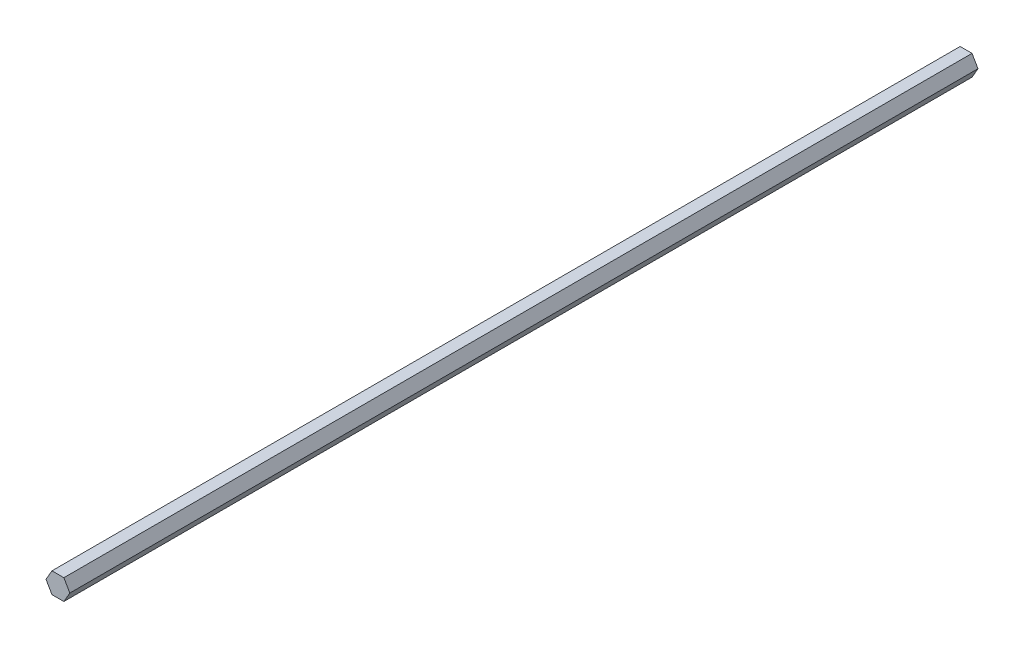
ISO-10303-21;
HEADER;
FILE_DESCRIPTION(('STEP AP214'),'2;1');
FILE_NAME('part.step','',(''),(''),'','','');
FILE_SCHEMA(('AUTOMOTIVE_DESIGN { 1 0 10303 214 1 1 1 1 }'));
ENDSEC;
DATA;
#1=APPLICATION_CONTEXT('core data for automotive mechanical design processes');
#2=APPLICATION_PROTOCOL_DEFINITION('international standard','automotive_design',2000,#1);
#3=PRODUCT_CONTEXT('',#1,'mechanical');
#4=PRODUCT('Part','Part','',(#3));
#5=PRODUCT_RELATED_PRODUCT_CATEGORY('part','',(#4));
#6=PRODUCT_DEFINITION_FORMATION('','',#4);
#7=PRODUCT_DEFINITION_CONTEXT('part definition',#1,'design');
#8=PRODUCT_DEFINITION('design','',#6,#7);
#9=PRODUCT_DEFINITION_SHAPE('','',#8);
#10=(LENGTH_UNIT() NAMED_UNIT(*) SI_UNIT(.MILLI.,.METRE.));
#11=(NAMED_UNIT(*) PLANE_ANGLE_UNIT() SI_UNIT($,.RADIAN.));
#12=(NAMED_UNIT(*) SI_UNIT($,.STERADIAN.) SOLID_ANGLE_UNIT());
#13=UNCERTAINTY_MEASURE_WITH_UNIT(LENGTH_MEASURE(1.E-05),#10,'distance_accuracy_value','');
#14=(GEOMETRIC_REPRESENTATION_CONTEXT(3) GLOBAL_UNCERTAINTY_ASSIGNED_CONTEXT((#13)) GLOBAL_UNIT_ASSIGNED_CONTEXT((#10,
#11,#12)) REPRESENTATION_CONTEXT('',''));
#15=CARTESIAN_POINT('',(0.,0.,0.));
#16=DIRECTION('',(0.,0.,1.));
#17=DIRECTION('',(1.,0.,0.));
#18=AXIS2_PLACEMENT_3D('',#15,#16,#17);
#19=CARTESIAN_POINT('',(-3.66617420935412,-6.35,558.8));
#20=DIRECTION('',(0.,1.,0.));
#21=DIRECTION('',(0.,0.,1.));
#22=AXIS2_PLACEMENT_3D('',#19,#20,#21);
#23=PLANE('',#22);
#24=DIRECTION('',(1.,0.,0.));
#25=VECTOR('',#24,1.);
#26=CARTESIAN_POINT('',(-3.66617420935412,-6.35,0.));
#27=LINE('',#26,#25);
#28=CARTESIAN_POINT('',(-3.66617420935412,-6.35,0.));
#29=VERTEX_POINT('',#28);
#30=CARTESIAN_POINT('',(3.66617420935412,-6.35,0.));
#31=VERTEX_POINT('',#30);
#32=EDGE_CURVE('E119',#29,#31,#27,.T.);
#33=ORIENTED_EDGE('',*,*,#32,.T.);
#34=DIRECTION('',(0.,0.,-1.));
#35=VECTOR('',#34,1.);
#36=CARTESIAN_POINT('',(3.66617420935412,-6.35,558.8));
#37=LINE('',#36,#35);
#38=CARTESIAN_POINT('',(3.66617420935412,-6.35,558.8));
#39=VERTEX_POINT('',#38);
#40=EDGE_CURVE('E11',#39,#31,#37,.T.);
#41=ORIENTED_EDGE('',*,*,#40,.F.);
#42=DIRECTION('',(1.,0.,0.));
#43=VECTOR('',#42,1.);
#44=CARTESIAN_POINT('',(-3.66617420935412,-6.35,558.8));
#45=LINE('',#44,#43);
#46=CARTESIAN_POINT('',(-3.66617420935412,-6.35,558.8));
#47=VERTEX_POINT('',#46);
#48=EDGE_CURVE('E129',#47,#39,#45,.T.);
#49=ORIENTED_EDGE('',*,*,#48,.F.);
#50=DIRECTION('',(0.,0.,-1.));
#51=VECTOR('',#50,1.);
#52=CARTESIAN_POINT('',(-3.66617420935412,-6.35,558.8));
#53=LINE('',#52,#51);
#54=EDGE_CURVE('E115',#47,#29,#53,.T.);
#55=ORIENTED_EDGE('',*,*,#54,.T.);
#56=EDGE_LOOP('',(#33,#41,#49,#55));
#57=FACE_BOUND('',#56,.T.);
#58=ADVANCED_FACE('F35',(#57),#23,.F.);
#59=CARTESIAN_POINT('',(3.66617420935412,-6.35,558.8));
#60=DIRECTION('',(-0.866025403784439,0.5,0.));
#61=DIRECTION('',(-0.5,-0.866025403784439,0.));
#62=AXIS2_PLACEMENT_3D('',#59,#60,#61);
#63=PLANE('',#62);
#64=DIRECTION('',(0.5,0.866025403784439,0.));
#65=VECTOR('',#64,1.);
#66=CARTESIAN_POINT('',(3.66617420935412,-6.35,0.));
#67=LINE('',#66,#65);
#68=CARTESIAN_POINT('',(7.33234841870824,0.,0.));
#69=VERTEX_POINT('',#68);
#70=EDGE_CURVE('E122',#31,#69,#67,.T.);
#71=ORIENTED_EDGE('',*,*,#70,.T.);
#72=DIRECTION('',(0.,0.,-1.));
#73=VECTOR('',#72,1.);
#74=CARTESIAN_POINT('',(7.33234841870824,0.,558.8));
#75=LINE('',#74,#73);
#76=CARTESIAN_POINT('',(7.33234841870824,0.,558.8));
#77=VERTEX_POINT('',#76);
#78=EDGE_CURVE('E43',#77,#69,#75,.T.);
#79=ORIENTED_EDGE('',*,*,#78,.F.);
#80=DIRECTION('',(0.5,0.866025403784439,0.));
#81=VECTOR('',#80,1.);
#82=CARTESIAN_POINT('',(3.66617420935412,-6.35,558.8));
#83=LINE('',#82,#81);
#84=EDGE_CURVE('E88',#39,#77,#83,.T.);
#85=ORIENTED_EDGE('',*,*,#84,.F.);
#86=ORIENTED_EDGE('',*,*,#40,.T.);
#87=EDGE_LOOP('',(#71,#79,#85,#86));
#88=FACE_BOUND('',#87,.T.);
#89=ADVANCED_FACE('F153',(#88),#63,.F.);
#90=CARTESIAN_POINT('',(7.33234841870824,0.,558.8));
#91=DIRECTION('',(-0.866025403784438,-0.5,0.));
#92=DIRECTION('',(0.5,-0.866025403784438,0.));
#93=AXIS2_PLACEMENT_3D('',#90,#91,#92);
#94=PLANE('',#93);
#95=DIRECTION('',(-0.5,0.866025403784438,0.));
#96=VECTOR('',#95,1.);
#97=CARTESIAN_POINT('',(7.33234841870824,0.,0.));
#98=LINE('',#97,#96);
#99=CARTESIAN_POINT('',(3.66617420935412,6.35,0.));
#100=VERTEX_POINT('',#99);
#101=EDGE_CURVE('E124',#69,#100,#98,.T.);
#102=ORIENTED_EDGE('',*,*,#101,.T.);
#103=DIRECTION('',(0.,0.,-1.));
#104=VECTOR('',#103,1.);
#105=CARTESIAN_POINT('',(3.66617420935412,6.35,558.8));
#106=LINE('',#105,#104);
#107=CARTESIAN_POINT('',(3.66617420935412,6.35,558.8));
#108=VERTEX_POINT('',#107);
#109=EDGE_CURVE('E110',#108,#100,#106,.T.);
#110=ORIENTED_EDGE('',*,*,#109,.F.);
#111=DIRECTION('',(-0.5,0.866025403784438,0.));
#112=VECTOR('',#111,1.);
#113=CARTESIAN_POINT('',(7.33234841870824,0.,558.8));
#114=LINE('',#113,#112);
#115=EDGE_CURVE('E101',#77,#108,#114,.T.);
#116=ORIENTED_EDGE('',*,*,#115,.F.);
#117=ORIENTED_EDGE('',*,*,#78,.T.);
#118=EDGE_LOOP('',(#102,#110,#116,#117));
#119=FACE_BOUND('',#118,.T.);
#120=ADVANCED_FACE('F135',(#119),#94,.F.);
#121=CARTESIAN_POINT('',(3.66617420935412,6.35,558.8));
#122=DIRECTION('',(0.,-1.,0.));
#123=DIRECTION('',(1.,0.,0.));
#124=AXIS2_PLACEMENT_3D('',#121,#122,#123);
#125=PLANE('',#124);
#126=DIRECTION('',(-1.,0.,0.));
#127=VECTOR('',#126,1.);
#128=CARTESIAN_POINT('',(3.66617420935412,6.35,0.));
#129=LINE('',#128,#127);
#130=CARTESIAN_POINT('',(-3.66617420935413,6.35,0.));
#131=VERTEX_POINT('',#130);
#132=EDGE_CURVE('E109',#100,#131,#129,.T.);
#133=ORIENTED_EDGE('',*,*,#132,.T.);
#134=DIRECTION('',(0.,0.,-1.));
#135=VECTOR('',#134,1.);
#136=CARTESIAN_POINT('',(-3.66617420935413,6.35,558.8));
#137=LINE('',#136,#135);
#138=CARTESIAN_POINT('',(-3.66617420935413,6.35,558.8));
#139=VERTEX_POINT('',#138);
#140=EDGE_CURVE('E106',#139,#131,#137,.T.);
#141=ORIENTED_EDGE('',*,*,#140,.F.);
#142=DIRECTION('',(-1.,0.,0.));
#143=VECTOR('',#142,1.);
#144=CARTESIAN_POINT('',(3.66617420935412,6.35,558.8));
#145=LINE('',#144,#143);
#146=EDGE_CURVE('E95',#108,#139,#145,.T.);
#147=ORIENTED_EDGE('',*,*,#146,.F.);
#148=ORIENTED_EDGE('',*,*,#109,.T.);
#149=EDGE_LOOP('',(#133,#141,#147,#148));
#150=FACE_BOUND('',#149,.T.);
#151=ADVANCED_FACE('F107',(#150),#125,.F.);
#152=CARTESIAN_POINT('',(-3.66617420935413,6.35,558.8));
#153=DIRECTION('',(0.866025403784439,-0.5,0.));
#154=DIRECTION('',(0.5,0.866025403784439,0.));
#155=AXIS2_PLACEMENT_3D('',#152,#153,#154);
#156=PLANE('',#155);
#157=DIRECTION('',(-0.5,-0.866025403784439,0.));
#158=VECTOR('',#157,1.);
#159=CARTESIAN_POINT('',(-3.66617420935413,6.35,0.));
#160=LINE('',#159,#158);
#161=CARTESIAN_POINT('',(-7.33234841870825,0.,0.));
#162=VERTEX_POINT('',#161);
#163=EDGE_CURVE('E74',#131,#162,#160,.T.);
#164=ORIENTED_EDGE('',*,*,#163,.T.);
#165=DIRECTION('',(0.,0.,-1.));
#166=VECTOR('',#165,1.);
#167=CARTESIAN_POINT('',(-7.33234841870825,0.,558.8));
#168=LINE('',#167,#166);
#169=CARTESIAN_POINT('',(-7.33234841870825,0.,558.8));
#170=VERTEX_POINT('',#169);
#171=EDGE_CURVE('E111',#170,#162,#168,.T.);
#172=ORIENTED_EDGE('',*,*,#171,.F.);
#173=DIRECTION('',(-0.5,-0.866025403784439,0.));
#174=VECTOR('',#173,1.);
#175=CARTESIAN_POINT('',(-3.66617420935413,6.35,558.8));
#176=LINE('',#175,#174);
#177=EDGE_CURVE('E99',#139,#170,#176,.T.);
#178=ORIENTED_EDGE('',*,*,#177,.F.);
#179=ORIENTED_EDGE('',*,*,#140,.T.);
#180=EDGE_LOOP('',(#164,#172,#178,#179));
#181=FACE_BOUND('',#180,.T.);
#182=ADVANCED_FACE('F113',(#181),#156,.F.);
#183=CARTESIAN_POINT('',(-7.33234841870825,0.,558.8));
#184=DIRECTION('',(0.866025403784439,0.5,0.));
#185=DIRECTION('',(-0.5,0.866025403784439,0.));
#186=AXIS2_PLACEMENT_3D('',#183,#184,#185);
#187=PLANE('',#186);
#188=DIRECTION('',(0.5,-0.866025403784439,0.));
#189=VECTOR('',#188,1.);
#190=CARTESIAN_POINT('',(-7.33234841870825,0.,0.));
#191=LINE('',#190,#189);
#192=EDGE_CURVE('E80',#162,#29,#191,.T.);
#193=ORIENTED_EDGE('',*,*,#192,.T.);
#194=ORIENTED_EDGE('',*,*,#54,.F.);
#195=DIRECTION('',(0.5,-0.866025403784439,0.));
#196=VECTOR('',#195,1.);
#197=CARTESIAN_POINT('',(-7.33234841870825,0.,558.8));
#198=LINE('',#197,#196);
#199=EDGE_CURVE('E51',#170,#47,#198,.T.);
#200=ORIENTED_EDGE('',*,*,#199,.F.);
#201=ORIENTED_EDGE('',*,*,#171,.T.);
#202=EDGE_LOOP('',(#193,#194,#200,#201));
#203=FACE_BOUND('',#202,.T.);
#204=ADVANCED_FACE('F142',(#203),#187,.F.);
#205=CARTESIAN_POINT('',(0.,0.,558.8));
#206=DIRECTION('',(0.,0.,1.));
#207=DIRECTION('',(1.,0.,0.));
#208=AXIS2_PLACEMENT_3D('',#205,#206,#207);
#209=PLANE('',#208);
#210=ORIENTED_EDGE('',*,*,#48,.T.);
#211=ORIENTED_EDGE('',*,*,#84,.T.);
#212=ORIENTED_EDGE('',*,*,#115,.T.);
#213=ORIENTED_EDGE('',*,*,#146,.T.);
#214=ORIENTED_EDGE('',*,*,#177,.T.);
#215=ORIENTED_EDGE('',*,*,#199,.T.);
#216=EDGE_LOOP('',(#210,#211,#212,#213,#214,#215));
#217=FACE_BOUND('',#216,.T.);
#218=ADVANCED_FACE('F97',(#217),#209,.T.);
#219=CARTESIAN_POINT('',(0.,0.,0.));
#220=DIRECTION('',(0.,0.,1.));
#221=DIRECTION('',(1.,0.,0.));
#222=AXIS2_PLACEMENT_3D('',#219,#220,#221);
#223=PLANE('',#222);
#224=ORIENTED_EDGE('',*,*,#32,.F.);
#225=ORIENTED_EDGE('',*,*,#192,.F.);
#226=ORIENTED_EDGE('',*,*,#163,.F.);
#227=ORIENTED_EDGE('',*,*,#132,.F.);
#228=ORIENTED_EDGE('',*,*,#101,.F.);
#229=ORIENTED_EDGE('',*,*,#70,.F.);
#230=EDGE_LOOP('',(#224,#225,#226,#227,#228,#229));
#231=FACE_BOUND('',#230,.T.);
#232=ADVANCED_FACE('F138',(#231),#223,.F.);
#233=CLOSED_SHELL('',(#58,#89,#120,#151,#182,#204,#218,#232));
#234=MANIFOLD_SOLID_BREP('B2',#233);
#235=ADVANCED_BREP_SHAPE_REPRESENTATION('',(#18,#234),#14);
#236=SHAPE_DEFINITION_REPRESENTATION(#9,#235);
ENDSEC;
END-ISO-10303-21;
